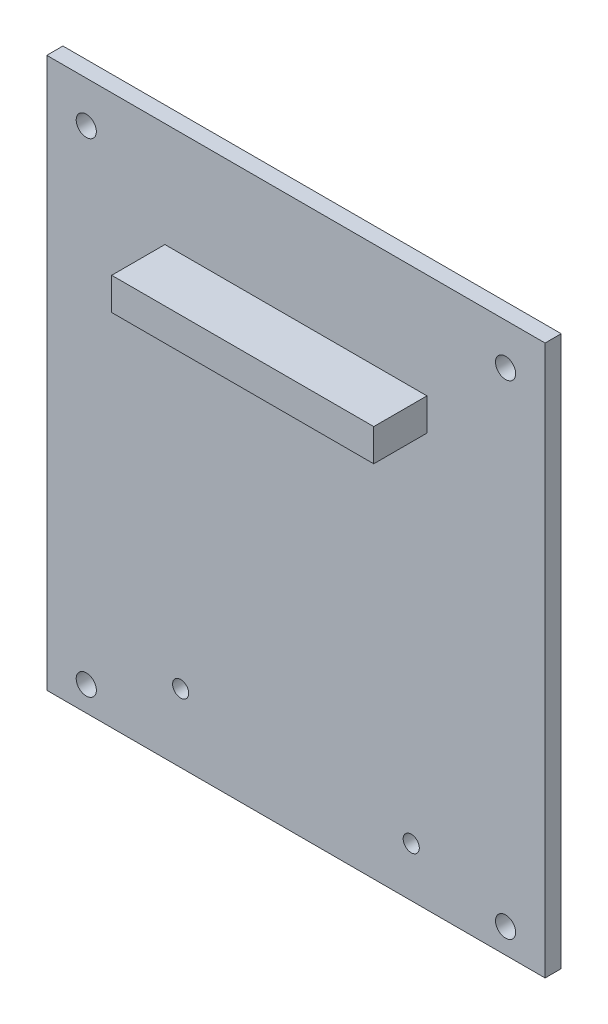
ISO-10303-21;
HEADER;
FILE_DESCRIPTION(('STEP AP214'),'2;1');
FILE_NAME('part.step','',(''),(''),'','','');
FILE_SCHEMA(('AUTOMOTIVE_DESIGN { 1 0 10303 214 1 1 1 1 }'));
ENDSEC;
DATA;
#1=APPLICATION_CONTEXT('core data for automotive mechanical design processes');
#2=APPLICATION_PROTOCOL_DEFINITION('international standard','automotive_design',2000,#1);
#3=PRODUCT_CONTEXT('',#1,'mechanical');
#4=PRODUCT('Part','Part','',(#3));
#5=PRODUCT_RELATED_PRODUCT_CATEGORY('part','',(#4));
#6=PRODUCT_DEFINITION_FORMATION('','',#4);
#7=PRODUCT_DEFINITION_CONTEXT('part definition',#1,'design');
#8=PRODUCT_DEFINITION('design','',#6,#7);
#9=PRODUCT_DEFINITION_SHAPE('','',#8);
#10=(LENGTH_UNIT() NAMED_UNIT(*) SI_UNIT(.MILLI.,.METRE.));
#11=(NAMED_UNIT(*) PLANE_ANGLE_UNIT() SI_UNIT($,.RADIAN.));
#12=(NAMED_UNIT(*) SI_UNIT($,.STERADIAN.) SOLID_ANGLE_UNIT());
#13=UNCERTAINTY_MEASURE_WITH_UNIT(LENGTH_MEASURE(1.E-05),#10,'distance_accuracy_value','');
#14=(GEOMETRIC_REPRESENTATION_CONTEXT(3) GLOBAL_UNCERTAINTY_ASSIGNED_CONTEXT((#13)) GLOBAL_UNIT_ASSIGNED_CONTEXT((#10,
#11,#12)) REPRESENTATION_CONTEXT('',''));
#15=CARTESIAN_POINT('',(0.,0.,0.));
#16=DIRECTION('',(0.,0.,1.));
#17=DIRECTION('',(1.,0.,0.));
#18=AXIS2_PLACEMENT_3D('',#15,#16,#17);
#19=CARTESIAN_POINT('',(0.,0.,2.54));
#20=DIRECTION('',(0.,0.,1.));
#21=DIRECTION('',(1.,0.,0.));
#22=AXIS2_PLACEMENT_3D('',#19,#20,#21);
#23=PLANE('',#22);
#24=CARTESIAN_POINT('',(21.082,10.7569,2.54));
#25=DIRECTION('',(0.,0.,1.));
#26=DIRECTION('',(1.,0.,0.));
#27=AXIS2_PLACEMENT_3D('',#24,#25,#26);
#28=CIRCLE('',#27,1.27);
#29=CARTESIAN_POINT('',(22.352,10.7569,2.54));
#30=VERTEX_POINT('',#29);
#31=EDGE_CURVE('E253',#30,#30,#28,.T.);
#32=ORIENTED_EDGE('',*,*,#31,.F.);
#33=EDGE_LOOP('',(#32));
#34=FACE_BOUND('',#33,.T.);
#35=CARTESIAN_POINT('',(57.404,7.81049999999999,2.54));
#36=DIRECTION('',(0.,0.,1.));
#37=DIRECTION('',(1.,0.,0.));
#38=AXIS2_PLACEMENT_3D('',#35,#36,#37);
#39=CIRCLE('',#38,1.26999999999999);
#40=CARTESIAN_POINT('',(58.674,7.81049999999999,2.54));
#41=VERTEX_POINT('',#40);
#42=EDGE_CURVE('E258',#41,#41,#39,.T.);
#43=ORIENTED_EDGE('',*,*,#42,.F.);
#44=EDGE_LOOP('',(#43));
#45=FACE_BOUND('',#44,.T.);
#46=CARTESIAN_POINT('',(72.263,3.91160000000003,2.54));
#47=DIRECTION('',(0.,0.,1.));
#48=DIRECTION('',(1.,0.,0.));
#49=AXIS2_PLACEMENT_3D('',#46,#47,#48);
#50=CIRCLE('',#49,1.58749999999999);
#51=CARTESIAN_POINT('',(73.8505,3.91160000000003,2.54));
#52=VERTEX_POINT('',#51);
#53=EDGE_CURVE('E143',#52,#52,#50,.T.);
#54=ORIENTED_EDGE('',*,*,#53,.F.);
#55=EDGE_LOOP('',(#54));
#56=FACE_BOUND('',#55,.T.);
#57=CARTESIAN_POINT('',(6.22299999999995,80.1116,2.54));
#58=DIRECTION('',(0.,0.,1.));
#59=DIRECTION('',(1.,0.,0.));
#60=AXIS2_PLACEMENT_3D('',#57,#58,#59);
#61=CIRCLE('',#60,1.58749999999999);
#62=CARTESIAN_POINT('',(7.81049999999995,80.1116,2.54));
#63=VERTEX_POINT('',#62);
#64=EDGE_CURVE('E155',#63,#63,#61,.T.);
#65=ORIENTED_EDGE('',*,*,#64,.F.);
#66=EDGE_LOOP('',(#65));
#67=FACE_BOUND('',#66,.T.);
#68=DIRECTION('',(0.,-1.,0.));
#69=VECTOR('',#68,1.);
#70=CARTESIAN_POINT('',(0.,86.614,2.54));
#71=LINE('',#70,#69);
#72=CARTESIAN_POINT('',(0.,86.614,2.54));
#73=VERTEX_POINT('',#72);
#74=CARTESIAN_POINT('',(0.,0.,2.54));
#75=VERTEX_POINT('',#74);
#76=EDGE_CURVE('E161',#73,#75,#71,.T.);
#77=ORIENTED_EDGE('',*,*,#76,.T.);
#78=DIRECTION('',(1.,0.,0.));
#79=VECTOR('',#78,1.);
#80=CARTESIAN_POINT('',(0.,0.,2.54));
#81=LINE('',#80,#79);
#82=CARTESIAN_POINT('',(78.486,0.,2.54));
#83=VERTEX_POINT('',#82);
#84=EDGE_CURVE('E85',#75,#83,#81,.T.);
#85=ORIENTED_EDGE('',*,*,#84,.T.);
#86=DIRECTION('',(0.,1.,0.));
#87=VECTOR('',#86,1.);
#88=CARTESIAN_POINT('',(78.486,86.614,2.54));
#89=LINE('',#88,#87);
#90=CARTESIAN_POINT('',(78.486,86.614,2.54));
#91=VERTEX_POINT('',#90);
#92=EDGE_CURVE('E164',#83,#91,#89,.T.);
#93=ORIENTED_EDGE('',*,*,#92,.T.);
#94=DIRECTION('',(-1.,0.,0.));
#95=VECTOR('',#94,1.);
#96=CARTESIAN_POINT('',(0.,86.614,2.54));
#97=LINE('',#96,#95);
#98=EDGE_CURVE('E57',#91,#73,#97,.T.);
#99=ORIENTED_EDGE('',*,*,#98,.T.);
#100=EDGE_LOOP('',(#77,#85,#93,#99));
#101=FACE_BOUND('',#100,.T.);
#102=CARTESIAN_POINT('',(72.2629999999999,80.1116,2.54));
#103=DIRECTION('',(0.,0.,1.));
#104=DIRECTION('',(1.,0.,0.));
#105=AXIS2_PLACEMENT_3D('',#102,#103,#104);
#106=CIRCLE('',#105,1.5875);
#107=CARTESIAN_POINT('',(73.8505,80.1116,2.54));
#108=VERTEX_POINT('',#107);
#109=EDGE_CURVE('E149',#108,#108,#106,.T.);
#110=ORIENTED_EDGE('',*,*,#109,.F.);
#111=EDGE_LOOP('',(#110));
#112=FACE_BOUND('',#111,.T.);
#113=CARTESIAN_POINT('',(6.223,3.91159999999997,2.54));
#114=DIRECTION('',(0.,0.,1.));
#115=DIRECTION('',(1.,0.,0.));
#116=AXIS2_PLACEMENT_3D('',#113,#114,#115);
#117=CIRCLE('',#116,1.58749999999999);
#118=CARTESIAN_POINT('',(7.8105,3.91159999999997,2.54));
#119=VERTEX_POINT('',#118);
#120=EDGE_CURVE('E135',#119,#119,#117,.T.);
#121=ORIENTED_EDGE('',*,*,#120,.F.);
#122=EDGE_LOOP('',(#121));
#123=FACE_BOUND('',#122,.T.);
#124=DIRECTION('',(1.,0.,0.));
#125=VECTOR('',#124,1.);
#126=CARTESIAN_POINT('',(18.6055,65.0239999999999,2.54));
#127=LINE('',#126,#125);
#128=CARTESIAN_POINT('',(18.6055,65.0239999999999,2.54));
#129=VERTEX_POINT('',#128);
#130=CARTESIAN_POINT('',(59.8805,65.024,2.54));
#131=VERTEX_POINT('',#130);
#132=EDGE_CURVE('E267',#129,#131,#127,.T.);
#133=ORIENTED_EDGE('',*,*,#132,.F.);
#134=DIRECTION('',(0.,-1.,0.));
#135=VECTOR('',#134,1.);
#136=CARTESIAN_POINT('',(18.6055,70.104,2.54));
#137=LINE('',#136,#135);
#138=CARTESIAN_POINT('',(18.6055,70.104,2.54));
#139=VERTEX_POINT('',#138);
#140=EDGE_CURVE('E130',#139,#129,#137,.T.);
#141=ORIENTED_EDGE('',*,*,#140,.F.);
#142=DIRECTION('',(-1.,0.,0.));
#143=VECTOR('',#142,1.);
#144=CARTESIAN_POINT('',(18.6055,70.104,2.54));
#145=LINE('',#144,#143);
#146=CARTESIAN_POINT('',(59.8805,70.104,2.54));
#147=VERTEX_POINT('',#146);
#148=EDGE_CURVE('E126',#147,#139,#145,.T.);
#149=ORIENTED_EDGE('',*,*,#148,.F.);
#150=DIRECTION('',(0.,1.,0.));
#151=VECTOR('',#150,1.);
#152=CARTESIAN_POINT('',(59.8805,70.104,2.54));
#153=LINE('',#152,#151);
#154=EDGE_CURVE('E269',#131,#147,#153,.T.);
#155=ORIENTED_EDGE('',*,*,#154,.F.);
#156=EDGE_LOOP('',(#133,#141,#149,#155));
#157=FACE_BOUND('',#156,.T.);
#158=ADVANCED_FACE('F33',(#34,#45,#56,#67,#101,#112,#123,#157),#23,.T.);
#159=CARTESIAN_POINT('',(0.,0.,0.));
#160=DIRECTION('',(0.,0.,1.));
#161=DIRECTION('',(1.,0.,0.));
#162=AXIS2_PLACEMENT_3D('',#159,#160,#161);
#163=PLANE('',#162);
#164=CARTESIAN_POINT('',(21.082,10.7569,0.));
#165=DIRECTION('',(0.,0.,1.));
#166=DIRECTION('',(1.,0.,0.));
#167=AXIS2_PLACEMENT_3D('',#164,#165,#166);
#168=CIRCLE('',#167,1.27);
#169=CARTESIAN_POINT('',(22.352,10.7569,0.));
#170=VERTEX_POINT('',#169);
#171=EDGE_CURVE('E251',#170,#170,#168,.F.);
#172=ORIENTED_EDGE('',*,*,#171,.F.);
#173=EDGE_LOOP('',(#172));
#174=FACE_BOUND('',#173,.T.);
#175=CARTESIAN_POINT('',(57.404,7.81049999999999,0.));
#176=DIRECTION('',(0.,0.,1.));
#177=DIRECTION('',(1.,0.,0.));
#178=AXIS2_PLACEMENT_3D('',#175,#176,#177);
#179=CIRCLE('',#178,1.26999999999999);
#180=CARTESIAN_POINT('',(58.674,7.81049999999999,0.));
#181=VERTEX_POINT('',#180);
#182=EDGE_CURVE('E254',#181,#181,#179,.F.);
#183=ORIENTED_EDGE('',*,*,#182,.F.);
#184=EDGE_LOOP('',(#183));
#185=FACE_BOUND('',#184,.T.);
#186=DIRECTION('',(0.,-1.,0.));
#187=VECTOR('',#186,1.);
#188=CARTESIAN_POINT('',(0.,86.614,0.));
#189=LINE('',#188,#187);
#190=CARTESIAN_POINT('',(0.,86.614,0.));
#191=VERTEX_POINT('',#190);
#192=CARTESIAN_POINT('',(0.,0.,0.));
#193=VERTEX_POINT('',#192);
#194=EDGE_CURVE('E158',#191,#193,#189,.T.);
#195=ORIENTED_EDGE('',*,*,#194,.F.);
#196=DIRECTION('',(-1.,0.,0.));
#197=VECTOR('',#196,1.);
#198=CARTESIAN_POINT('',(0.,86.614,0.));
#199=LINE('',#198,#197);
#200=CARTESIAN_POINT('',(78.486,86.614,0.));
#201=VERTEX_POINT('',#200);
#202=EDGE_CURVE('E78',#201,#191,#199,.T.);
#203=ORIENTED_EDGE('',*,*,#202,.F.);
#204=DIRECTION('',(0.,1.,0.));
#205=VECTOR('',#204,1.);
#206=CARTESIAN_POINT('',(78.486,86.614,0.));
#207=LINE('',#206,#205);
#208=CARTESIAN_POINT('',(78.486,0.,0.));
#209=VERTEX_POINT('',#208);
#210=EDGE_CURVE('E172',#209,#201,#207,.T.);
#211=ORIENTED_EDGE('',*,*,#210,.F.);
#212=DIRECTION('',(1.,0.,0.));
#213=VECTOR('',#212,1.);
#214=CARTESIAN_POINT('',(0.,0.,0.));
#215=LINE('',#214,#213);
#216=EDGE_CURVE('E170',#193,#209,#215,.T.);
#217=ORIENTED_EDGE('',*,*,#216,.F.);
#218=EDGE_LOOP('',(#195,#203,#211,#217));
#219=FACE_BOUND('',#218,.T.);
#220=CARTESIAN_POINT('',(6.22299999999995,80.1116,0.));
#221=DIRECTION('',(0.,0.,1.));
#222=DIRECTION('',(1.,0.,0.));
#223=AXIS2_PLACEMENT_3D('',#220,#221,#222);
#224=CIRCLE('',#223,1.58749999999999);
#225=CARTESIAN_POINT('',(7.81049999999995,80.1116,0.));
#226=VERTEX_POINT('',#225);
#227=EDGE_CURVE('E152',#226,#226,#224,.T.);
#228=ORIENTED_EDGE('',*,*,#227,.T.);
#229=EDGE_LOOP('',(#228));
#230=FACE_BOUND('',#229,.T.);
#231=CARTESIAN_POINT('',(72.2629999999999,80.1116,0.));
#232=DIRECTION('',(0.,0.,1.));
#233=DIRECTION('',(1.,0.,0.));
#234=AXIS2_PLACEMENT_3D('',#231,#232,#233);
#235=CIRCLE('',#234,1.5875);
#236=CARTESIAN_POINT('',(73.8505,80.1116,0.));
#237=VERTEX_POINT('',#236);
#238=EDGE_CURVE('E146',#237,#237,#235,.T.);
#239=ORIENTED_EDGE('',*,*,#238,.T.);
#240=EDGE_LOOP('',(#239));
#241=FACE_BOUND('',#240,.T.);
#242=CARTESIAN_POINT('',(72.263,3.91160000000003,0.));
#243=DIRECTION('',(0.,0.,1.));
#244=DIRECTION('',(1.,0.,0.));
#245=AXIS2_PLACEMENT_3D('',#242,#243,#244);
#246=CIRCLE('',#245,1.58749999999999);
#247=CARTESIAN_POINT('',(73.8505,3.91160000000003,0.));
#248=VERTEX_POINT('',#247);
#249=EDGE_CURVE('E141',#248,#248,#246,.T.);
#250=ORIENTED_EDGE('',*,*,#249,.T.);
#251=EDGE_LOOP('',(#250));
#252=FACE_BOUND('',#251,.T.);
#253=CARTESIAN_POINT('',(6.223,3.91159999999997,0.));
#254=DIRECTION('',(0.,0.,1.));
#255=DIRECTION('',(1.,0.,0.));
#256=AXIS2_PLACEMENT_3D('',#253,#254,#255);
#257=CIRCLE('',#256,1.58749999999999);
#258=CARTESIAN_POINT('',(7.8105,3.91159999999997,0.));
#259=VERTEX_POINT('',#258);
#260=EDGE_CURVE('E132',#259,#259,#257,.T.);
#261=ORIENTED_EDGE('',*,*,#260,.T.);
#262=EDGE_LOOP('',(#261));
#263=FACE_BOUND('',#262,.T.);
#264=ADVANCED_FACE('F185',(#174,#185,#219,#230,#241,#252,#263),#163,.F.);
#265=CARTESIAN_POINT('',(0.,86.614,2.54));
#266=DIRECTION('',(1.,0.,0.));
#267=DIRECTION('',(0.,1.,0.));
#268=AXIS2_PLACEMENT_3D('',#265,#266,#267);
#269=PLANE('',#268);
#270=ORIENTED_EDGE('',*,*,#194,.T.);
#271=DIRECTION('',(0.,0.,-1.));
#272=VECTOR('',#271,1.);
#273=CARTESIAN_POINT('',(0.,0.,2.54));
#274=LINE('',#273,#272);
#275=EDGE_CURVE('E11',#75,#193,#274,.T.);
#276=ORIENTED_EDGE('',*,*,#275,.F.);
#277=ORIENTED_EDGE('',*,*,#76,.F.);
#278=DIRECTION('',(0.,0.,-1.));
#279=VECTOR('',#278,1.);
#280=CARTESIAN_POINT('',(0.,86.614,2.54));
#281=LINE('',#280,#279);
#282=EDGE_CURVE('E167',#73,#191,#281,.T.);
#283=ORIENTED_EDGE('',*,*,#282,.T.);
#284=EDGE_LOOP('',(#270,#276,#277,#283));
#285=FACE_BOUND('',#284,.T.);
#286=ADVANCED_FACE('F35',(#285),#269,.F.);
#287=CARTESIAN_POINT('',(0.,0.,2.54));
#288=DIRECTION('',(0.,1.,0.));
#289=DIRECTION('',(-1.,0.,0.));
#290=AXIS2_PLACEMENT_3D('',#287,#288,#289);
#291=PLANE('',#290);
#292=ORIENTED_EDGE('',*,*,#216,.T.);
#293=DIRECTION('',(0.,0.,-1.));
#294=VECTOR('',#293,1.);
#295=CARTESIAN_POINT('',(78.486,0.,2.54));
#296=LINE('',#295,#294);
#297=EDGE_CURVE('E41',#83,#209,#296,.T.);
#298=ORIENTED_EDGE('',*,*,#297,.F.);
#299=ORIENTED_EDGE('',*,*,#84,.F.);
#300=ORIENTED_EDGE('',*,*,#275,.T.);
#301=EDGE_LOOP('',(#292,#298,#299,#300));
#302=FACE_BOUND('',#301,.T.);
#303=ADVANCED_FACE('F201',(#302),#291,.F.);
#304=CARTESIAN_POINT('',(78.486,86.614,2.54));
#305=DIRECTION('',(-1.,0.,0.));
#306=DIRECTION('',(0.,-1.,0.));
#307=AXIS2_PLACEMENT_3D('',#304,#305,#306);
#308=PLANE('',#307);
#309=ORIENTED_EDGE('',*,*,#210,.T.);
#310=DIRECTION('',(0.,0.,-1.));
#311=VECTOR('',#310,1.);
#312=CARTESIAN_POINT('',(78.486,86.614,2.54));
#313=LINE('',#312,#311);
#314=EDGE_CURVE('E176',#91,#201,#313,.T.);
#315=ORIENTED_EDGE('',*,*,#314,.F.);
#316=ORIENTED_EDGE('',*,*,#92,.F.);
#317=ORIENTED_EDGE('',*,*,#297,.T.);
#318=EDGE_LOOP('',(#309,#315,#316,#317));
#319=FACE_BOUND('',#318,.T.);
#320=ADVANCED_FACE('F181',(#319),#308,.F.);
#321=CARTESIAN_POINT('',(0.,86.614,2.54));
#322=DIRECTION('',(0.,-1.,0.));
#323=DIRECTION('',(1.,0.,0.));
#324=AXIS2_PLACEMENT_3D('',#321,#322,#323);
#325=PLANE('',#324);
#326=ORIENTED_EDGE('',*,*,#202,.T.);
#327=ORIENTED_EDGE('',*,*,#282,.F.);
#328=ORIENTED_EDGE('',*,*,#98,.F.);
#329=ORIENTED_EDGE('',*,*,#314,.T.);
#330=EDGE_LOOP('',(#326,#327,#328,#329));
#331=FACE_BOUND('',#330,.T.);
#332=ADVANCED_FACE('F190',(#331),#325,.F.);
#333=CARTESIAN_POINT('',(6.22299999999995,80.1116,2.54));
#334=DIRECTION('',(0.,0.,-1.));
#335=DIRECTION('',(-1.,0.,0.));
#336=AXIS2_PLACEMENT_3D('',#333,#334,#335);
#337=CYLINDRICAL_SURFACE('',#336,1.58749999999999);
#338=ORIENTED_EDGE('',*,*,#64,.T.);
#339=EDGE_LOOP('',(#338));
#340=FACE_BOUND('',#339,.T.);
#341=ORIENTED_EDGE('',*,*,#227,.F.);
#342=EDGE_LOOP('',(#341));
#343=FACE_BOUND('',#342,.T.);
#344=ADVANCED_FACE('F192',(#340,#343),#337,.F.);
#345=CARTESIAN_POINT('',(72.2629999999999,80.1116,2.54));
#346=DIRECTION('',(0.,0.,-1.));
#347=DIRECTION('',(-1.,0.,0.));
#348=AXIS2_PLACEMENT_3D('',#345,#346,#347);
#349=CYLINDRICAL_SURFACE('',#348,1.5875);
#350=ORIENTED_EDGE('',*,*,#109,.T.);
#351=EDGE_LOOP('',(#350));
#352=FACE_BOUND('',#351,.T.);
#353=ORIENTED_EDGE('',*,*,#238,.F.);
#354=EDGE_LOOP('',(#353));
#355=FACE_BOUND('',#354,.T.);
#356=ADVANCED_FACE('F198',(#352,#355),#349,.F.);
#357=CARTESIAN_POINT('',(72.263,3.91160000000003,2.54));
#358=DIRECTION('',(0.,0.,-1.));
#359=DIRECTION('',(-1.,0.,0.));
#360=AXIS2_PLACEMENT_3D('',#357,#358,#359);
#361=CYLINDRICAL_SURFACE('',#360,1.58749999999999);
#362=ORIENTED_EDGE('',*,*,#53,.T.);
#363=EDGE_LOOP('',(#362));
#364=FACE_BOUND('',#363,.T.);
#365=ORIENTED_EDGE('',*,*,#249,.F.);
#366=EDGE_LOOP('',(#365));
#367=FACE_BOUND('',#366,.T.);
#368=ADVANCED_FACE('F217',(#364,#367),#361,.F.);
#369=CARTESIAN_POINT('',(6.223,3.91159999999997,2.54));
#370=DIRECTION('',(0.,0.,-1.));
#371=DIRECTION('',(-1.,0.,0.));
#372=AXIS2_PLACEMENT_3D('',#369,#370,#371);
#373=CYLINDRICAL_SURFACE('',#372,1.58749999999999);
#374=ORIENTED_EDGE('',*,*,#120,.T.);
#375=EDGE_LOOP('',(#374));
#376=FACE_BOUND('',#375,.T.);
#377=ORIENTED_EDGE('',*,*,#260,.F.);
#378=EDGE_LOOP('',(#377));
#379=FACE_BOUND('',#378,.T.);
#380=ADVANCED_FACE('F221',(#376,#379),#373,.F.);
#381=CARTESIAN_POINT('',(18.6055,70.104,10.922));
#382=DIRECTION('',(1.,0.,0.));
#383=DIRECTION('',(0.,0.,-1.));
#384=AXIS2_PLACEMENT_3D('',#381,#382,#383);
#385=PLANE('',#384);
#386=ORIENTED_EDGE('',*,*,#140,.T.);
#387=DIRECTION('',(0.,0.,-1.));
#388=VECTOR('',#387,1.);
#389=CARTESIAN_POINT('',(18.6055,65.0239999999999,10.922));
#390=LINE('',#389,#388);
#391=CARTESIAN_POINT('',(18.6055,65.0239999999999,10.922));
#392=VERTEX_POINT('',#391);
#393=EDGE_CURVE('E111',#392,#129,#390,.T.);
#394=ORIENTED_EDGE('',*,*,#393,.F.);
#395=DIRECTION('',(0.,-1.,0.));
#396=VECTOR('',#395,1.);
#397=CARTESIAN_POINT('',(18.6055,70.104,10.922));
#398=LINE('',#397,#396);
#399=CARTESIAN_POINT('',(18.6055,70.104,10.922));
#400=VERTEX_POINT('',#399);
#401=EDGE_CURVE('E118',#400,#392,#398,.T.);
#402=ORIENTED_EDGE('',*,*,#401,.F.);
#403=DIRECTION('',(0.,0.,-1.));
#404=VECTOR('',#403,1.);
#405=CARTESIAN_POINT('',(18.6055,70.104,10.922));
#406=LINE('',#405,#404);
#407=EDGE_CURVE('E265',#400,#139,#406,.T.);
#408=ORIENTED_EDGE('',*,*,#407,.T.);
#409=EDGE_LOOP('',(#386,#394,#402,#408));
#410=FACE_BOUND('',#409,.T.);
#411=ADVANCED_FACE('F128',(#410),#385,.F.);
#412=CARTESIAN_POINT('',(18.6055,65.0239999999999,10.922));
#413=DIRECTION('',(0.,1.,0.));
#414=DIRECTION('',(-1.,0.,0.));
#415=AXIS2_PLACEMENT_3D('',#412,#413,#414);
#416=PLANE('',#415);
#417=ORIENTED_EDGE('',*,*,#132,.T.);
#418=DIRECTION('',(0.,0.,-1.));
#419=VECTOR('',#418,1.);
#420=CARTESIAN_POINT('',(59.8805,65.024,10.922));
#421=LINE('',#420,#419);
#422=CARTESIAN_POINT('',(59.8805,65.024,10.922));
#423=VERTEX_POINT('',#422);
#424=EDGE_CURVE('E114',#423,#131,#421,.T.);
#425=ORIENTED_EDGE('',*,*,#424,.F.);
#426=DIRECTION('',(1.,0.,0.));
#427=VECTOR('',#426,1.);
#428=CARTESIAN_POINT('',(18.6055,65.0239999999999,10.922));
#429=LINE('',#428,#427);
#430=EDGE_CURVE('E107',#392,#423,#429,.T.);
#431=ORIENTED_EDGE('',*,*,#430,.F.);
#432=ORIENTED_EDGE('',*,*,#393,.T.);
#433=EDGE_LOOP('',(#417,#425,#431,#432));
#434=FACE_BOUND('',#433,.T.);
#435=ADVANCED_FACE('F109',(#434),#416,.F.);
#436=CARTESIAN_POINT('',(59.8805,70.104,10.922));
#437=DIRECTION('',(-1.,0.,0.));
#438=DIRECTION('',(0.,-1.,0.));
#439=AXIS2_PLACEMENT_3D('',#436,#437,#438);
#440=PLANE('',#439);
#441=ORIENTED_EDGE('',*,*,#154,.T.);
#442=DIRECTION('',(0.,0.,-1.));
#443=VECTOR('',#442,1.);
#444=CARTESIAN_POINT('',(59.8805,70.104,10.922));
#445=LINE('',#444,#443);
#446=CARTESIAN_POINT('',(59.8805,70.104,10.922));
#447=VERTEX_POINT('',#446);
#448=EDGE_CURVE('E48',#447,#147,#445,.T.);
#449=ORIENTED_EDGE('',*,*,#448,.F.);
#450=DIRECTION('',(0.,1.,0.));
#451=VECTOR('',#450,1.);
#452=CARTESIAN_POINT('',(59.8805,70.104,10.922));
#453=LINE('',#452,#451);
#454=EDGE_CURVE('E117',#423,#447,#453,.T.);
#455=ORIENTED_EDGE('',*,*,#454,.F.);
#456=ORIENTED_EDGE('',*,*,#424,.T.);
#457=EDGE_LOOP('',(#441,#449,#455,#456));
#458=FACE_BOUND('',#457,.T.);
#459=ADVANCED_FACE('F230',(#458),#440,.F.);
#460=CARTESIAN_POINT('',(18.6055,70.104,10.922));
#461=DIRECTION('',(0.,-1.,0.));
#462=DIRECTION('',(1.,0.,0.));
#463=AXIS2_PLACEMENT_3D('',#460,#461,#462);
#464=PLANE('',#463);
#465=ORIENTED_EDGE('',*,*,#148,.T.);
#466=ORIENTED_EDGE('',*,*,#407,.F.);
#467=DIRECTION('',(-1.,0.,0.));
#468=VECTOR('',#467,1.);
#469=CARTESIAN_POINT('',(18.6055,70.104,10.922));
#470=LINE('',#469,#468);
#471=EDGE_CURVE('E122',#447,#400,#470,.T.);
#472=ORIENTED_EDGE('',*,*,#471,.F.);
#473=ORIENTED_EDGE('',*,*,#448,.T.);
#474=EDGE_LOOP('',(#465,#466,#472,#473));
#475=FACE_BOUND('',#474,.T.);
#476=ADVANCED_FACE('F233',(#475),#464,.F.);
#477=CARTESIAN_POINT('',(0.,0.,10.922));
#478=DIRECTION('',(0.,0.,1.));
#479=DIRECTION('',(1.,0.,0.));
#480=AXIS2_PLACEMENT_3D('',#477,#478,#479);
#481=PLANE('',#480);
#482=ORIENTED_EDGE('',*,*,#401,.T.);
#483=ORIENTED_EDGE('',*,*,#430,.T.);
#484=ORIENTED_EDGE('',*,*,#454,.T.);
#485=ORIENTED_EDGE('',*,*,#471,.T.);
#486=EDGE_LOOP('',(#482,#483,#484,#485));
#487=FACE_BOUND('',#486,.T.);
#488=ADVANCED_FACE('F121',(#487),#481,.T.);
#489=CARTESIAN_POINT('',(57.404,7.81049999999999,-3.59210244842766));
#490=DIRECTION('',(0.,0.,1.));
#491=DIRECTION('',(1.,0.,0.));
#492=AXIS2_PLACEMENT_3D('',#489,#490,#491);
#493=CYLINDRICAL_SURFACE('',#492,1.26999999999999);
#494=ORIENTED_EDGE('',*,*,#182,.T.);
#495=EDGE_LOOP('',(#494));
#496=FACE_BOUND('',#495,.T.);
#497=ORIENTED_EDGE('',*,*,#42,.T.);
#498=EDGE_LOOP('',(#497));
#499=FACE_BOUND('',#498,.T.);
#500=ADVANCED_FACE('F239',(#496,#499),#493,.F.);
#501=CARTESIAN_POINT('',(21.082,10.7569,-3.59210244842766));
#502=DIRECTION('',(0.,0.,1.));
#503=DIRECTION('',(1.,0.,0.));
#504=AXIS2_PLACEMENT_3D('',#501,#502,#503);
#505=CYLINDRICAL_SURFACE('',#504,1.27);
#506=ORIENTED_EDGE('',*,*,#171,.T.);
#507=EDGE_LOOP('',(#506));
#508=FACE_BOUND('',#507,.T.);
#509=ORIENTED_EDGE('',*,*,#31,.T.);
#510=EDGE_LOOP('',(#509));
#511=FACE_BOUND('',#510,.T.);
#512=ADVANCED_FACE('F242',(#508,#511),#505,.F.);
#513=CLOSED_SHELL('',(#158,#264,#286,#303,#320,#332,#344,#356,#368,#380,#411,#435,#459,#476,
#488,#500,#512));
#514=MANIFOLD_SOLID_BREP('B2',#513);
#515=ADVANCED_BREP_SHAPE_REPRESENTATION('',(#18,#514),#14);
#516=SHAPE_DEFINITION_REPRESENTATION(#9,#515);
ENDSEC;
END-ISO-10303-21;
